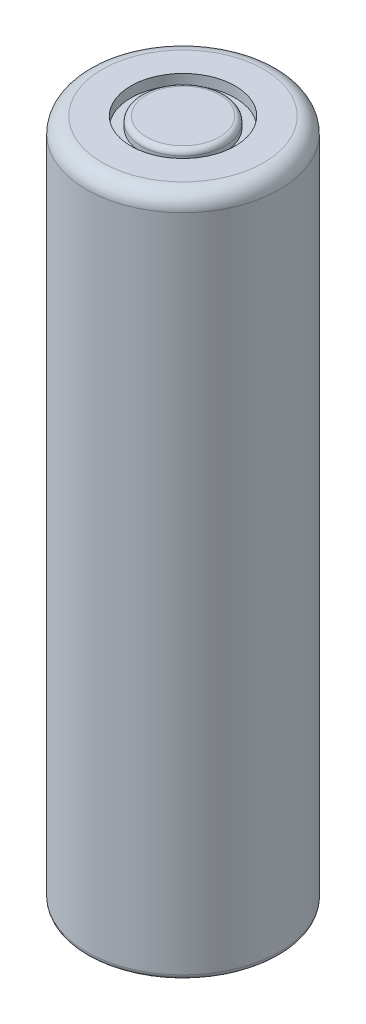
ISO-10303-21;
HEADER;
FILE_DESCRIPTION(('STEP AP214'),'2;1');
FILE_NAME('part.step','',(''),(''),'','','');
FILE_SCHEMA(('AUTOMOTIVE_DESIGN { 1 0 10303 214 1 1 1 1 }'));
ENDSEC;
DATA;
#1=APPLICATION_CONTEXT('core data for automotive mechanical design processes');
#2=APPLICATION_PROTOCOL_DEFINITION('international standard','automotive_design',2000,#1);
#3=PRODUCT_CONTEXT('',#1,'mechanical');
#4=PRODUCT('Part','Part','',(#3));
#5=PRODUCT_RELATED_PRODUCT_CATEGORY('part','',(#4));
#6=PRODUCT_DEFINITION_FORMATION('','',#4);
#7=PRODUCT_DEFINITION_CONTEXT('part definition',#1,'design');
#8=PRODUCT_DEFINITION('design','',#6,#7);
#9=PRODUCT_DEFINITION_SHAPE('','',#8);
#10=(LENGTH_UNIT() NAMED_UNIT(*) SI_UNIT(.MILLI.,.METRE.));
#11=(NAMED_UNIT(*) PLANE_ANGLE_UNIT() SI_UNIT($,.RADIAN.));
#12=(NAMED_UNIT(*) SI_UNIT($,.STERADIAN.) SOLID_ANGLE_UNIT());
#13=UNCERTAINTY_MEASURE_WITH_UNIT(LENGTH_MEASURE(1.E-05),#10,'distance_accuracy_value','');
#14=(GEOMETRIC_REPRESENTATION_CONTEXT(3) GLOBAL_UNCERTAINTY_ASSIGNED_CONTEXT((#13)) GLOBAL_UNIT_ASSIGNED_CONTEXT((#10,
#11,#12)) REPRESENTATION_CONTEXT('',''));
#15=CARTESIAN_POINT('',(0.,0.,0.));
#16=DIRECTION('',(0.,0.,1.));
#17=DIRECTION('',(1.,0.,0.));
#18=AXIS2_PLACEMENT_3D('',#15,#16,#17);
#19=CARTESIAN_POINT('',(0.,65.3,0.));
#20=DIRECTION('',(0.,-1.,0.));
#21=DIRECTION('',(0.,0.,-1.));
#22=AXIS2_PLACEMENT_3D('',#19,#20,#21);
#23=CYLINDRICAL_SURFACE('',#22,9.25);
#24=CARTESIAN_POINT('',(0.,0.5,0.));
#25=DIRECTION('',(0.,1.,0.));
#26=DIRECTION('',(0.,0.,1.));
#27=AXIS2_PLACEMENT_3D('',#24,#25,#26);
#28=CIRCLE('',#27,9.25);
#29=CARTESIAN_POINT('',(0.,0.5,9.25));
#30=VERTEX_POINT('',#29);
#31=EDGE_CURVE('E51',#30,#30,#28,.T.);
#32=ORIENTED_EDGE('',*,*,#31,.T.);
#33=EDGE_LOOP('',(#32));
#34=FACE_BOUND('',#33,.T.);
#35=CARTESIAN_POINT('',(0.,63.8,0.));
#36=DIRECTION('',(0.,1.,0.));
#37=DIRECTION('',(0.,0.,1.));
#38=AXIS2_PLACEMENT_3D('',#35,#36,#37);
#39=CIRCLE('',#38,9.25);
#40=CARTESIAN_POINT('',(0.,63.8,9.25));
#41=VERTEX_POINT('',#40);
#42=EDGE_CURVE('E56',#41,#41,#39,.F.);
#43=ORIENTED_EDGE('',*,*,#42,.T.);
#44=EDGE_LOOP('',(#43));
#45=FACE_BOUND('',#44,.T.);
#46=ADVANCED_FACE('F36',(#34,#45),#23,.T.);
#47=CARTESIAN_POINT('',(0.,65.3,0.));
#48=DIRECTION('',(0.,1.,0.));
#49=DIRECTION('',(0.,0.,1.));
#50=AXIS2_PLACEMENT_3D('',#47,#48,#49);
#51=PLANE('',#50);
#52=CARTESIAN_POINT('',(0.,65.3,0.));
#53=DIRECTION('',(0.,1.,0.));
#54=DIRECTION('',(0.,0.,1.));
#55=AXIS2_PLACEMENT_3D('',#52,#53,#54);
#56=CIRCLE('',#55,5.);
#57=CARTESIAN_POINT('',(0.,65.3,5.));
#58=VERTEX_POINT('',#57);
#59=EDGE_CURVE('E63',#58,#58,#56,.T.);
#60=ORIENTED_EDGE('',*,*,#59,.F.);
#61=EDGE_LOOP('',(#60));
#62=FACE_BOUND('',#61,.T.);
#63=CARTESIAN_POINT('',(0.,65.3,0.));
#64=DIRECTION('',(0.,1.,0.));
#65=DIRECTION('',(0.,0.,1.));
#66=AXIS2_PLACEMENT_3D('',#63,#64,#65);
#67=CIRCLE('',#66,7.75);
#68=CARTESIAN_POINT('',(0.,65.3,7.75));
#69=VERTEX_POINT('',#68);
#70=EDGE_CURVE('E59',#69,#69,#67,.T.);
#71=ORIENTED_EDGE('',*,*,#70,.T.);
#72=EDGE_LOOP('',(#71));
#73=FACE_BOUND('',#72,.T.);
#74=ADVANCED_FACE('F87',(#62,#73),#51,.T.);
#75=CARTESIAN_POINT('',(0.,0.,0.));
#76=DIRECTION('',(0.,1.,0.));
#77=DIRECTION('',(0.,0.,1.));
#78=AXIS2_PLACEMENT_3D('',#75,#76,#77);
#79=PLANE('',#78);
#80=CARTESIAN_POINT('',(0.,0.,0.));
#81=DIRECTION('',(0.,1.,0.));
#82=DIRECTION('',(0.,0.,1.));
#83=AXIS2_PLACEMENT_3D('',#80,#81,#82);
#84=CIRCLE('',#83,8.75);
#85=CARTESIAN_POINT('',(0.,0.,8.75));
#86=VERTEX_POINT('',#85);
#87=EDGE_CURVE('E47',#86,#86,#84,.F.);
#88=ORIENTED_EDGE('',*,*,#87,.T.);
#89=EDGE_LOOP('',(#88));
#90=FACE_BOUND('',#89,.T.);
#91=ADVANCED_FACE('F90',(#90),#79,.F.);
#92=CARTESIAN_POINT('',(0.,63.8,0.));
#93=DIRECTION('',(0.,1.,0.));
#94=DIRECTION('',(0.,0.,1.));
#95=AXIS2_PLACEMENT_3D('',#92,#93,#94);
#96=TOROIDAL_SURFACE('',#95,7.75,1.5);
#97=ORIENTED_EDGE('',*,*,#42,.F.);
#98=EDGE_LOOP('',(#97));
#99=FACE_BOUND('',#98,.T.);
#100=ORIENTED_EDGE('',*,*,#70,.F.);
#101=EDGE_LOOP('',(#100));
#102=FACE_BOUND('',#101,.T.);
#103=ADVANCED_FACE('F95',(#99,#102),#96,.T.);
#104=CARTESIAN_POINT('',(0.,0.5,0.));
#105=DIRECTION('',(0.,1.,0.));
#106=DIRECTION('',(0.,0.,1.));
#107=AXIS2_PLACEMENT_3D('',#104,#105,#106);
#108=TOROIDAL_SURFACE('',#107,8.75,0.5);
#109=ORIENTED_EDGE('',*,*,#87,.F.);
#110=EDGE_LOOP('',(#109));
#111=FACE_BOUND('',#110,.T.);
#112=ORIENTED_EDGE('',*,*,#31,.F.);
#113=EDGE_LOOP('',(#112));
#114=FACE_BOUND('',#113,.T.);
#115=ADVANCED_FACE('F83',(#111,#114),#108,.T.);
#116=CARTESIAN_POINT('',(0.,64.3,0.));
#117=DIRECTION('',(0.,1.,0.));
#118=DIRECTION('',(0.,0.,1.));
#119=AXIS2_PLACEMENT_3D('',#116,#117,#118);
#120=CYLINDRICAL_SURFACE('',#119,5.);
#121=CARTESIAN_POINT('',(0.,64.3,0.));
#122=DIRECTION('',(0.,1.,0.));
#123=DIRECTION('',(0.,0.,1.));
#124=AXIS2_PLACEMENT_3D('',#121,#122,#123);
#125=CIRCLE('',#124,5.);
#126=CARTESIAN_POINT('',(0.,64.3,5.));
#127=VERTEX_POINT('',#126);
#128=EDGE_CURVE('E62',#127,#127,#125,.T.);
#129=ORIENTED_EDGE('',*,*,#128,.F.);
#130=EDGE_LOOP('',(#129));
#131=FACE_BOUND('',#130,.T.);
#132=ORIENTED_EDGE('',*,*,#59,.T.);
#133=EDGE_LOOP('',(#132));
#134=FACE_BOUND('',#133,.T.);
#135=ADVANCED_FACE('F77',(#131,#134),#120,.F.);
#136=CARTESIAN_POINT('',(0.,64.3,0.));
#137=DIRECTION('',(0.,1.,0.));
#138=DIRECTION('',(0.,0.,1.));
#139=AXIS2_PLACEMENT_3D('',#136,#137,#138);
#140=PLANE('',#139);
#141=CARTESIAN_POINT('',(0.,64.3,0.));
#142=DIRECTION('',(0.,1.,0.));
#143=DIRECTION('',(0.,0.,1.));
#144=AXIS2_PLACEMENT_3D('',#141,#142,#143);
#145=CIRCLE('',#144,4.);
#146=CARTESIAN_POINT('',(0.,64.3,4.));
#147=VERTEX_POINT('',#146);
#148=EDGE_CURVE('E66',#147,#147,#145,.T.);
#149=ORIENTED_EDGE('',*,*,#148,.F.);
#150=EDGE_LOOP('',(#149));
#151=FACE_BOUND('',#150,.T.);
#152=ORIENTED_EDGE('',*,*,#128,.T.);
#153=EDGE_LOOP('',(#152));
#154=FACE_BOUND('',#153,.T.);
#155=ADVANCED_FACE('F74',(#151,#154),#140,.T.);
#156=CARTESIAN_POINT('',(0.,64.3,0.));
#157=DIRECTION('',(0.,1.,0.));
#158=DIRECTION('',(0.,0.,1.));
#159=AXIS2_PLACEMENT_3D('',#156,#157,#158);
#160=CYLINDRICAL_SURFACE('',#159,4.);
#161=CARTESIAN_POINT('',(0.,64.8,0.));
#162=DIRECTION('',(0.,1.,0.));
#163=DIRECTION('',(0.,0.,1.));
#164=AXIS2_PLACEMENT_3D('',#161,#162,#163);
#165=CIRCLE('',#164,4.);
#166=CARTESIAN_POINT('',(0.,64.8,4.));
#167=VERTEX_POINT('',#166);
#168=EDGE_CURVE('E10',#167,#167,#165,.F.);
#169=ORIENTED_EDGE('',*,*,#168,.T.);
#170=EDGE_LOOP('',(#169));
#171=FACE_BOUND('',#170,.T.);
#172=ORIENTED_EDGE('',*,*,#148,.T.);
#173=EDGE_LOOP('',(#172));
#174=FACE_BOUND('',#173,.T.);
#175=ADVANCED_FACE('F72',(#171,#174),#160,.T.);
#176=CARTESIAN_POINT('',(0.,65.3,0.));
#177=DIRECTION('',(0.,1.,0.));
#178=DIRECTION('',(0.,0.,1.));
#179=AXIS2_PLACEMENT_3D('',#176,#177,#178);
#180=CIRCLE('',#179,3.5);
#181=CARTESIAN_POINT('',(0.,65.3,3.5));
#182=VERTEX_POINT('',#181);
#183=EDGE_CURVE('E43',#182,#182,#180,.T.);
#184=ORIENTED_EDGE('',*,*,#183,.T.);
#185=EDGE_LOOP('',(#184));
#186=FACE_BOUND('',#185,.T.);
#187=ADVANCED_FACE('F92',(#186),#51,.T.);
#188=CARTESIAN_POINT('',(0.,64.8,0.));
#189=DIRECTION('',(0.,1.,0.));
#190=DIRECTION('',(0.,0.,1.));
#191=AXIS2_PLACEMENT_3D('',#188,#189,#190);
#192=TOROIDAL_SURFACE('',#191,3.5,0.5);
#193=ORIENTED_EDGE('',*,*,#168,.F.);
#194=EDGE_LOOP('',(#193));
#195=FACE_BOUND('',#194,.T.);
#196=ORIENTED_EDGE('',*,*,#183,.F.);
#197=EDGE_LOOP('',(#196));
#198=FACE_BOUND('',#197,.T.);
#199=ADVANCED_FACE('F38',(#195,#198),#192,.T.);
#200=CLOSED_SHELL('',(#46,#74,#91,#103,#115,#135,#155,#175,#187,#199));
#201=MANIFOLD_SOLID_BREP('B2',#200);
#202=ADVANCED_BREP_SHAPE_REPRESENTATION('',(#18,#201),#14);
#203=SHAPE_DEFINITION_REPRESENTATION(#9,#202);
ENDSEC;
END-ISO-10303-21;
